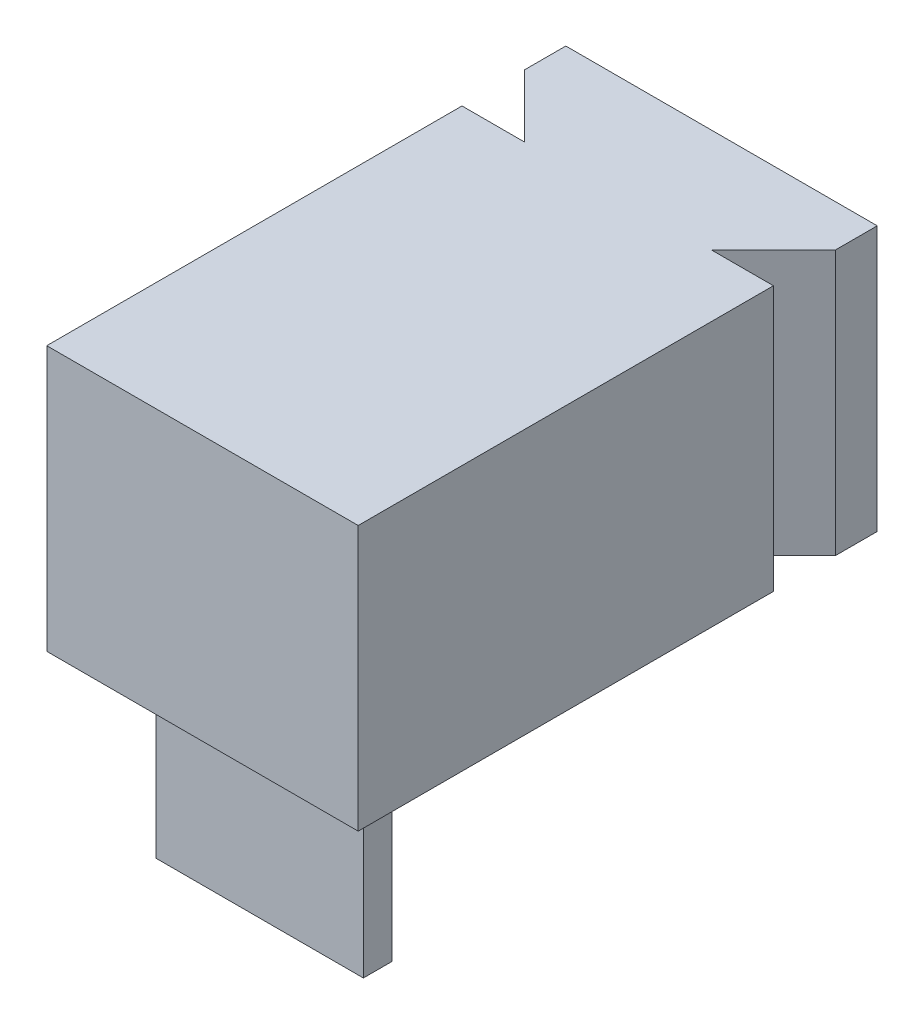
ISO-10303-21;
HEADER;
FILE_DESCRIPTION(('STEP AP214'),'2;1');
FILE_NAME('part.step','',(''),(''),'','','');
FILE_SCHEMA(('AUTOMOTIVE_DESIGN { 1 0 10303 214 1 1 1 1 }'));
ENDSEC;
DATA;
#1=APPLICATION_CONTEXT('core data for automotive mechanical design processes');
#2=APPLICATION_PROTOCOL_DEFINITION('international standard','automotive_design',2000,#1);
#3=PRODUCT_CONTEXT('',#1,'mechanical');
#4=PRODUCT('Part','Part','',(#3));
#5=PRODUCT_RELATED_PRODUCT_CATEGORY('part','',(#4));
#6=PRODUCT_DEFINITION_FORMATION('','',#4);
#7=PRODUCT_DEFINITION_CONTEXT('part definition',#1,'design');
#8=PRODUCT_DEFINITION('design','',#6,#7);
#9=PRODUCT_DEFINITION_SHAPE('','',#8);
#10=(LENGTH_UNIT() NAMED_UNIT(*) SI_UNIT(.MILLI.,.METRE.));
#11=(NAMED_UNIT(*) PLANE_ANGLE_UNIT() SI_UNIT($,.RADIAN.));
#12=(NAMED_UNIT(*) SI_UNIT($,.STERADIAN.) SOLID_ANGLE_UNIT());
#13=UNCERTAINTY_MEASURE_WITH_UNIT(LENGTH_MEASURE(1.E-05),#10,'distance_accuracy_value','');
#14=(GEOMETRIC_REPRESENTATION_CONTEXT(3) GLOBAL_UNCERTAINTY_ASSIGNED_CONTEXT((#13)) GLOBAL_UNIT_ASSIGNED_CONTEXT((#10,
#11,#12)) REPRESENTATION_CONTEXT('',''));
#15=CARTESIAN_POINT('',(0.,0.,0.));
#16=DIRECTION('',(0.,0.,1.));
#17=DIRECTION('',(1.,0.,0.));
#18=AXIS2_PLACEMENT_3D('',#15,#16,#17);
#19=CARTESIAN_POINT('',(0.,0.,0.));
#20=DIRECTION('',(0.,-1.,0.));
#21=DIRECTION('',(0.,0.,-1.));
#22=AXIS2_PLACEMENT_3D('',#19,#20,#21);
#23=PLANE('',#22);
#24=DIRECTION('',(0.,0.,-1.));
#25=VECTOR('',#24,1.);
#26=CARTESIAN_POINT('',(3.,0.,4.));
#27=LINE('',#26,#25);
#28=CARTESIAN_POINT('',(3.,0.,4.));
#29=VERTEX_POINT('',#28);
#30=CARTESIAN_POINT('',(3.,0.,-4.));
#31=VERTEX_POINT('',#30);
#32=EDGE_CURVE('E216',#29,#31,#27,.T.);
#33=ORIENTED_EDGE('',*,*,#32,.F.);
#34=DIRECTION('',(1.,0.,0.));
#35=VECTOR('',#34,1.);
#36=CARTESIAN_POINT('',(-3.,0.,4.));
#37=LINE('',#36,#35);
#38=CARTESIAN_POINT('',(-3.,0.,4.));
#39=VERTEX_POINT('',#38);
#40=EDGE_CURVE('E249',#39,#29,#37,.T.);
#41=ORIENTED_EDGE('',*,*,#40,.F.);
#42=DIRECTION('',(0.,0.,1.));
#43=VECTOR('',#42,1.);
#44=CARTESIAN_POINT('',(-3.,0.,4.));
#45=LINE('',#44,#43);
#46=CARTESIAN_POINT('',(-3.,0.,-4.));
#47=VERTEX_POINT('',#46);
#48=EDGE_CURVE('E234',#47,#39,#45,.T.);
#49=ORIENTED_EDGE('',*,*,#48,.F.);
#50=DIRECTION('',(-1.,0.,0.));
#51=VECTOR('',#50,1.);
#52=CARTESIAN_POINT('',(-3.,0.,-4.));
#53=LINE('',#52,#51);
#54=CARTESIAN_POINT('',(-1.80000000000002,0.,-4.));
#55=VERTEX_POINT('',#54);
#56=EDGE_CURVE('E228',#55,#47,#53,.T.);
#57=ORIENTED_EDGE('',*,*,#56,.F.);
#58=DIRECTION('',(-0.707106781186543,0.,-0.707106781186552));
#59=VECTOR('',#58,1.);
#60=CARTESIAN_POINT('',(-3.,0.,-5.2));
#61=LINE('',#60,#59);
#62=CARTESIAN_POINT('',(-3.,0.,-5.2));
#63=VERTEX_POINT('',#62);
#64=EDGE_CURVE('E183',#55,#63,#61,.T.);
#65=ORIENTED_EDGE('',*,*,#64,.T.);
#66=DIRECTION('',(0.,0.,-1.));
#67=VECTOR('',#66,1.);
#68=CARTESIAN_POINT('',(-3.,0.,-6.));
#69=LINE('',#68,#67);
#70=CARTESIAN_POINT('',(-3.,0.,-6.));
#71=VERTEX_POINT('',#70);
#72=EDGE_CURVE('E179',#63,#71,#69,.T.);
#73=ORIENTED_EDGE('',*,*,#72,.T.);
#74=DIRECTION('',(1.,0.,0.));
#75=VECTOR('',#74,1.);
#76=CARTESIAN_POINT('',(3.,0.,-6.));
#77=LINE('',#76,#75);
#78=CARTESIAN_POINT('',(3.,0.,-6.));
#79=VERTEX_POINT('',#78);
#80=EDGE_CURVE('E182',#71,#79,#77,.T.);
#81=ORIENTED_EDGE('',*,*,#80,.T.);
#82=DIRECTION('',(0.,0.,1.));
#83=VECTOR('',#82,1.);
#84=CARTESIAN_POINT('',(3.,0.,-5.2));
#85=LINE('',#84,#83);
#86=CARTESIAN_POINT('',(3.,0.,-5.2));
#87=VERTEX_POINT('',#86);
#88=EDGE_CURVE('E163',#79,#87,#85,.T.);
#89=ORIENTED_EDGE('',*,*,#88,.T.);
#90=DIRECTION('',(-0.707106781186551,0.,0.707106781186543));
#91=VECTOR('',#90,1.);
#92=CARTESIAN_POINT('',(1.79999999999999,0.,-4.));
#93=LINE('',#92,#91);
#94=CARTESIAN_POINT('',(1.79999999999999,0.,-4.));
#95=VERTEX_POINT('',#94);
#96=EDGE_CURVE('E166',#87,#95,#93,.T.);
#97=ORIENTED_EDGE('',*,*,#96,.T.);
#98=EDGE_CURVE('E235',#31,#95,#53,.T.);
#99=ORIENTED_EDGE('',*,*,#98,.F.);
#100=EDGE_LOOP('',(#33,#41,#49,#57,#65,#73,#81,#89,#97,#99));
#101=FACE_BOUND('',#100,.T.);
#102=DIRECTION('',(-1.,0.,0.));
#103=VECTOR('',#102,1.);
#104=CARTESIAN_POINT('',(-2.,0.,2.9));
#105=LINE('',#104,#103);
#106=CARTESIAN_POINT('',(2.,0.,2.9));
#107=VERTEX_POINT('',#106);
#108=CARTESIAN_POINT('',(-2.,0.,2.9));
#109=VERTEX_POINT('',#108);
#110=EDGE_CURVE('E431',#107,#109,#105,.T.);
#111=ORIENTED_EDGE('',*,*,#110,.F.);
#112=DIRECTION('',(0.,0.,1.));
#113=VECTOR('',#112,1.);
#114=CARTESIAN_POINT('',(2.,0.,2.35));
#115=LINE('',#114,#113);
#116=CARTESIAN_POINT('',(2.,0.,2.35));
#117=VERTEX_POINT('',#116);
#118=EDGE_CURVE('E161',#117,#107,#115,.T.);
#119=ORIENTED_EDGE('',*,*,#118,.F.);
#120=DIRECTION('',(1.,0.,0.));
#121=VECTOR('',#120,1.);
#122=CARTESIAN_POINT('',(-2.,0.,2.35));
#123=LINE('',#122,#121);
#124=CARTESIAN_POINT('',(-2.,0.,2.35));
#125=VERTEX_POINT('',#124);
#126=EDGE_CURVE('E157',#125,#117,#123,.T.);
#127=ORIENTED_EDGE('',*,*,#126,.F.);
#128=DIRECTION('',(0.,0.,-1.));
#129=VECTOR('',#128,1.);
#130=CARTESIAN_POINT('',(-2.,0.,2.35));
#131=LINE('',#130,#129);
#132=EDGE_CURVE('E428',#109,#125,#131,.T.);
#133=ORIENTED_EDGE('',*,*,#132,.F.);
#134=EDGE_LOOP('',(#111,#119,#127,#133));
#135=FACE_BOUND('',#134,.T.);
#136=ADVANCED_FACE('F35',(#101,#135),#23,.T.);
#137=CARTESIAN_POINT('',(-3.,5.1,-4.));
#138=DIRECTION('',(0.,0.,1.));
#139=DIRECTION('',(1.,0.,0.));
#140=AXIS2_PLACEMENT_3D('',#137,#138,#139);
#141=PLANE('',#140);
#142=DIRECTION('',(0.,-1.,0.));
#143=VECTOR('',#142,1.);
#144=CARTESIAN_POINT('',(1.79999999999999,11.4245553203368,-4.));
#145=LINE('',#144,#143);
#146=CARTESIAN_POINT('',(1.79999999999999,5.1,-4.));
#147=VERTEX_POINT('',#146);
#148=EDGE_CURVE('E200',#147,#95,#145,.T.);
#149=ORIENTED_EDGE('',*,*,#148,.F.);
#150=DIRECTION('',(-1.,0.,0.));
#151=VECTOR('',#150,1.);
#152=CARTESIAN_POINT('',(-3.,5.1,-4.));
#153=LINE('',#152,#151);
#154=CARTESIAN_POINT('',(3.,5.1,-4.));
#155=VERTEX_POINT('',#154);
#156=EDGE_CURVE('E242',#155,#147,#153,.T.);
#157=ORIENTED_EDGE('',*,*,#156,.F.);
#158=DIRECTION('',(0.,-1.,0.));
#159=VECTOR('',#158,1.);
#160=CARTESIAN_POINT('',(3.,5.1,-4.));
#161=LINE('',#160,#159);
#162=EDGE_CURVE('E11',#155,#31,#161,.T.);
#163=ORIENTED_EDGE('',*,*,#162,.T.);
#164=ORIENTED_EDGE('',*,*,#98,.T.);
#165=EDGE_LOOP('',(#149,#157,#163,#164));
#166=FACE_BOUND('',#165,.T.);
#167=ADVANCED_FACE('F276',(#166),#141,.F.);
#168=CARTESIAN_POINT('',(3.,5.1,4.));
#169=DIRECTION('',(-1.,0.,0.));
#170=DIRECTION('',(0.,0.,1.));
#171=AXIS2_PLACEMENT_3D('',#168,#169,#170);
#172=PLANE('',#171);
#173=ORIENTED_EDGE('',*,*,#32,.T.);
#174=ORIENTED_EDGE('',*,*,#162,.F.);
#175=DIRECTION('',(0.,0.,-1.));
#176=VECTOR('',#175,1.);
#177=CARTESIAN_POINT('',(3.,5.1,4.));
#178=LINE('',#177,#176);
#179=CARTESIAN_POINT('',(3.,5.1,4.));
#180=VERTEX_POINT('',#179);
#181=EDGE_CURVE('E251',#180,#155,#178,.T.);
#182=ORIENTED_EDGE('',*,*,#181,.F.);
#183=DIRECTION('',(0.,-1.,0.));
#184=VECTOR('',#183,1.);
#185=CARTESIAN_POINT('',(3.,5.1,4.));
#186=LINE('',#185,#184);
#187=EDGE_CURVE('E252',#180,#29,#186,.T.);
#188=ORIENTED_EDGE('',*,*,#187,.T.);
#189=EDGE_LOOP('',(#173,#174,#182,#188));
#190=FACE_BOUND('',#189,.T.);
#191=ADVANCED_FACE('F37',(#190),#172,.F.);
#192=CARTESIAN_POINT('',(-1.80000000000002,5.1,-4.));
#193=VERTEX_POINT('',#192);
#194=CARTESIAN_POINT('',(-3.,5.1,-4.));
#195=VERTEX_POINT('',#194);
#196=EDGE_CURVE('E60',#193,#195,#153,.T.);
#197=ORIENTED_EDGE('',*,*,#196,.F.);
#198=DIRECTION('',(0.,-1.,0.));
#199=VECTOR('',#198,1.);
#200=CARTESIAN_POINT('',(-1.80000000000002,11.4245553203368,-4.));
#201=LINE('',#200,#199);
#202=EDGE_CURVE('E193',#193,#55,#201,.T.);
#203=ORIENTED_EDGE('',*,*,#202,.T.);
#204=ORIENTED_EDGE('',*,*,#56,.T.);
#205=DIRECTION('',(0.,-1.,0.));
#206=VECTOR('',#205,1.);
#207=CARTESIAN_POINT('',(-3.,5.1,-4.));
#208=LINE('',#207,#206);
#209=EDGE_CURVE('E44',#195,#47,#208,.T.);
#210=ORIENTED_EDGE('',*,*,#209,.F.);
#211=EDGE_LOOP('',(#197,#203,#204,#210));
#212=FACE_BOUND('',#211,.T.);
#213=ADVANCED_FACE('F227',(#212),#141,.F.);
#214=CARTESIAN_POINT('',(-3.,5.1,4.));
#215=DIRECTION('',(1.,0.,0.));
#216=DIRECTION('',(0.,0.,-1.));
#217=AXIS2_PLACEMENT_3D('',#214,#215,#216);
#218=PLANE('',#217);
#219=ORIENTED_EDGE('',*,*,#48,.T.);
#220=DIRECTION('',(0.,-1.,0.));
#221=VECTOR('',#220,1.);
#222=CARTESIAN_POINT('',(-3.,5.1,4.));
#223=LINE('',#222,#221);
#224=CARTESIAN_POINT('',(-3.,5.1,4.));
#225=VERTEX_POINT('',#224);
#226=EDGE_CURVE('E255',#225,#39,#223,.T.);
#227=ORIENTED_EDGE('',*,*,#226,.F.);
#228=DIRECTION('',(0.,0.,1.));
#229=VECTOR('',#228,1.);
#230=CARTESIAN_POINT('',(-3.,5.1,4.));
#231=LINE('',#230,#229);
#232=EDGE_CURVE('E263',#195,#225,#231,.T.);
#233=ORIENTED_EDGE('',*,*,#232,.F.);
#234=ORIENTED_EDGE('',*,*,#209,.T.);
#235=EDGE_LOOP('',(#219,#227,#233,#234));
#236=FACE_BOUND('',#235,.T.);
#237=ADVANCED_FACE('F261',(#236),#218,.F.);
#238=CARTESIAN_POINT('',(-3.,5.1,4.));
#239=DIRECTION('',(0.,0.,-1.));
#240=DIRECTION('',(-1.,0.,0.));
#241=AXIS2_PLACEMENT_3D('',#238,#239,#240);
#242=PLANE('',#241);
#243=ORIENTED_EDGE('',*,*,#40,.T.);
#244=ORIENTED_EDGE('',*,*,#187,.F.);
#245=DIRECTION('',(1.,0.,0.));
#246=VECTOR('',#245,1.);
#247=CARTESIAN_POINT('',(-3.,5.1,4.));
#248=LINE('',#247,#246);
#249=EDGE_CURVE('E256',#225,#180,#248,.T.);
#250=ORIENTED_EDGE('',*,*,#249,.F.);
#251=ORIENTED_EDGE('',*,*,#226,.T.);
#252=EDGE_LOOP('',(#243,#244,#250,#251));
#253=FACE_BOUND('',#252,.T.);
#254=ADVANCED_FACE('F310',(#253),#242,.F.);
#255=CARTESIAN_POINT('',(0.,5.1,0.));
#256=DIRECTION('',(0.,-1.,0.));
#257=DIRECTION('',(0.,0.,-1.));
#258=AXIS2_PLACEMENT_3D('',#255,#256,#257);
#259=PLANE('',#258);
#260=ORIENTED_EDGE('',*,*,#181,.T.);
#261=ORIENTED_EDGE('',*,*,#156,.T.);
#262=DIRECTION('',(0.707106781186552,0.,-0.707106781186544));
#263=VECTOR('',#262,1.);
#264=CARTESIAN_POINT('',(1.79999999999999,5.1,-4.));
#265=LINE('',#264,#263);
#266=CARTESIAN_POINT('',(3.,5.1,-5.2));
#267=VERTEX_POINT('',#266);
#268=EDGE_CURVE('E177',#147,#267,#265,.T.);
#269=ORIENTED_EDGE('',*,*,#268,.T.);
#270=DIRECTION('',(0.,0.,-1.));
#271=VECTOR('',#270,1.);
#272=CARTESIAN_POINT('',(3.,5.1,-5.2));
#273=LINE('',#272,#271);
#274=CARTESIAN_POINT('',(3.,5.1,-6.));
#275=VERTEX_POINT('',#274);
#276=EDGE_CURVE('E176',#267,#275,#273,.T.);
#277=ORIENTED_EDGE('',*,*,#276,.T.);
#278=DIRECTION('',(-1.,0.,0.));
#279=VECTOR('',#278,1.);
#280=CARTESIAN_POINT('',(3.,5.1,-6.));
#281=LINE('',#280,#279);
#282=CARTESIAN_POINT('',(-3.,5.1,-6.));
#283=VERTEX_POINT('',#282);
#284=EDGE_CURVE('E173',#275,#283,#281,.T.);
#285=ORIENTED_EDGE('',*,*,#284,.T.);
#286=DIRECTION('',(0.,0.,1.));
#287=VECTOR('',#286,1.);
#288=CARTESIAN_POINT('',(-3.,5.1,-6.));
#289=LINE('',#288,#287);
#290=CARTESIAN_POINT('',(-3.,5.1,-5.2));
#291=VERTEX_POINT('',#290);
#292=EDGE_CURVE('E171',#283,#291,#289,.T.);
#293=ORIENTED_EDGE('',*,*,#292,.T.);
#294=DIRECTION('',(0.707106781186543,0.,0.707106781186552));
#295=VECTOR('',#294,1.);
#296=CARTESIAN_POINT('',(-3.,5.1,-5.2));
#297=LINE('',#296,#295);
#298=EDGE_CURVE('E174',#291,#193,#297,.T.);
#299=ORIENTED_EDGE('',*,*,#298,.T.);
#300=ORIENTED_EDGE('',*,*,#196,.T.);
#301=ORIENTED_EDGE('',*,*,#232,.T.);
#302=ORIENTED_EDGE('',*,*,#249,.T.);
#303=EDGE_LOOP('',(#260,#261,#269,#277,#285,#293,#299,#300,#301,#302));
#304=FACE_BOUND('',#303,.T.);
#305=ADVANCED_FACE('F222',(#304),#259,.F.);
#306=CARTESIAN_POINT('',(3.,11.4245553203368,-5.2));
#307=DIRECTION('',(1.,0.,0.));
#308=DIRECTION('',(0.,0.,-1.));
#309=AXIS2_PLACEMENT_3D('',#306,#307,#308);
#310=PLANE('',#309);
#311=ORIENTED_EDGE('',*,*,#276,.F.);
#312=DIRECTION('',(0.,-1.,0.));
#313=VECTOR('',#312,1.);
#314=CARTESIAN_POINT('',(3.,11.4245553203368,-5.2));
#315=LINE('',#314,#313);
#316=EDGE_CURVE('E186',#267,#87,#315,.T.);
#317=ORIENTED_EDGE('',*,*,#316,.T.);
#318=ORIENTED_EDGE('',*,*,#88,.F.);
#319=DIRECTION('',(0.,-1.,0.));
#320=VECTOR('',#319,1.);
#321=CARTESIAN_POINT('',(3.,11.4245553203368,-6.));
#322=LINE('',#321,#320);
#323=EDGE_CURVE('E187',#275,#79,#322,.T.);
#324=ORIENTED_EDGE('',*,*,#323,.F.);
#325=EDGE_LOOP('',(#311,#317,#318,#324));
#326=FACE_BOUND('',#325,.T.);
#327=ADVANCED_FACE('F283',(#326),#310,.T.);
#328=CARTESIAN_POINT('',(3.,11.4245553203368,-6.));
#329=DIRECTION('',(0.,0.,-1.));
#330=DIRECTION('',(-1.,0.,0.));
#331=AXIS2_PLACEMENT_3D('',#328,#329,#330);
#332=PLANE('',#331);
#333=ORIENTED_EDGE('',*,*,#284,.F.);
#334=ORIENTED_EDGE('',*,*,#323,.T.);
#335=ORIENTED_EDGE('',*,*,#80,.F.);
#336=DIRECTION('',(0.,-1.,0.));
#337=VECTOR('',#336,1.);
#338=CARTESIAN_POINT('',(-3.,11.4245553203368,-6.));
#339=LINE('',#338,#337);
#340=EDGE_CURVE('E189',#283,#71,#339,.T.);
#341=ORIENTED_EDGE('',*,*,#340,.F.);
#342=EDGE_LOOP('',(#333,#334,#335,#341));
#343=FACE_BOUND('',#342,.T.);
#344=ADVANCED_FACE('F291',(#343),#332,.T.);
#345=CARTESIAN_POINT('',(-3.,11.4245553203368,-6.));
#346=DIRECTION('',(-1.,0.,0.));
#347=DIRECTION('',(0.,0.,1.));
#348=AXIS2_PLACEMENT_3D('',#345,#346,#347);
#349=PLANE('',#348);
#350=ORIENTED_EDGE('',*,*,#292,.F.);
#351=ORIENTED_EDGE('',*,*,#340,.T.);
#352=ORIENTED_EDGE('',*,*,#72,.F.);
#353=DIRECTION('',(0.,-1.,0.));
#354=VECTOR('',#353,1.);
#355=CARTESIAN_POINT('',(-3.,11.4245553203368,-5.2));
#356=LINE('',#355,#354);
#357=EDGE_CURVE('E191',#291,#63,#356,.T.);
#358=ORIENTED_EDGE('',*,*,#357,.F.);
#359=EDGE_LOOP('',(#350,#351,#352,#358));
#360=FACE_BOUND('',#359,.T.);
#361=ADVANCED_FACE('F293',(#360),#349,.T.);
#362=CARTESIAN_POINT('',(-3.,11.4245553203368,-5.2));
#363=DIRECTION('',(-0.707106781186552,0.,0.707106781186543));
#364=DIRECTION('',(0.707106781186543,0.,0.707106781186552));
#365=AXIS2_PLACEMENT_3D('',#362,#363,#364);
#366=PLANE('',#365);
#367=ORIENTED_EDGE('',*,*,#298,.F.);
#368=ORIENTED_EDGE('',*,*,#357,.T.);
#369=ORIENTED_EDGE('',*,*,#64,.F.);
#370=ORIENTED_EDGE('',*,*,#202,.F.);
#371=EDGE_LOOP('',(#367,#368,#369,#370));
#372=FACE_BOUND('',#371,.T.);
#373=ADVANCED_FACE('F226',(#372),#366,.T.);
#374=CARTESIAN_POINT('',(1.79999999999999,11.4245553203368,-4.));
#375=DIRECTION('',(0.707106781186544,0.,0.707106781186552));
#376=DIRECTION('',(0.707106781186552,0.,-0.707106781186544));
#377=AXIS2_PLACEMENT_3D('',#374,#375,#376);
#378=PLANE('',#377);
#379=ORIENTED_EDGE('',*,*,#268,.F.);
#380=ORIENTED_EDGE('',*,*,#148,.T.);
#381=ORIENTED_EDGE('',*,*,#96,.F.);
#382=ORIENTED_EDGE('',*,*,#316,.F.);
#383=EDGE_LOOP('',(#379,#380,#381,#382));
#384=FACE_BOUND('',#383,.T.);
#385=ADVANCED_FACE('F285',(#384),#378,.T.);
#386=CARTESIAN_POINT('',(2.,-3.5,2.35));
#387=DIRECTION('',(-1.,0.,0.));
#388=DIRECTION('',(0.,0.,1.));
#389=AXIS2_PLACEMENT_3D('',#386,#387,#388);
#390=PLANE('',#389);
#391=ORIENTED_EDGE('',*,*,#118,.T.);
#392=DIRECTION('',(0.,1.,0.));
#393=VECTOR('',#392,1.);
#394=CARTESIAN_POINT('',(2.,-3.5,2.9));
#395=LINE('',#394,#393);
#396=CARTESIAN_POINT('',(2.,-3.5,2.9));
#397=VERTEX_POINT('',#396);
#398=EDGE_CURVE('E142',#397,#107,#395,.T.);
#399=ORIENTED_EDGE('',*,*,#398,.F.);
#400=DIRECTION('',(0.,0.,1.));
#401=VECTOR('',#400,1.);
#402=CARTESIAN_POINT('',(2.,-3.5,2.35));
#403=LINE('',#402,#401);
#404=CARTESIAN_POINT('',(2.,-3.5,2.35));
#405=VERTEX_POINT('',#404);
#406=EDGE_CURVE('E149',#405,#397,#403,.T.);
#407=ORIENTED_EDGE('',*,*,#406,.F.);
#408=DIRECTION('',(0.,1.,0.));
#409=VECTOR('',#408,1.);
#410=CARTESIAN_POINT('',(2.,-3.5,2.35));
#411=LINE('',#410,#409);
#412=EDGE_CURVE('E426',#405,#117,#411,.T.);
#413=ORIENTED_EDGE('',*,*,#412,.T.);
#414=EDGE_LOOP('',(#391,#399,#407,#413));
#415=FACE_BOUND('',#414,.T.);
#416=ADVANCED_FACE('F159',(#415),#390,.F.);
#417=CARTESIAN_POINT('',(-2.,-3.5,2.9));
#418=DIRECTION('',(0.,0.,-1.));
#419=DIRECTION('',(-1.,0.,0.));
#420=AXIS2_PLACEMENT_3D('',#417,#418,#419);
#421=PLANE('',#420);
#422=ORIENTED_EDGE('',*,*,#110,.T.);
#423=DIRECTION('',(0.,1.,0.));
#424=VECTOR('',#423,1.);
#425=CARTESIAN_POINT('',(-2.,-3.5,2.9));
#426=LINE('',#425,#424);
#427=CARTESIAN_POINT('',(-2.,-3.5,2.9));
#428=VERTEX_POINT('',#427);
#429=EDGE_CURVE('E145',#428,#109,#426,.T.);
#430=ORIENTED_EDGE('',*,*,#429,.F.);
#431=DIRECTION('',(-1.,0.,0.));
#432=VECTOR('',#431,1.);
#433=CARTESIAN_POINT('',(-2.,-3.5,2.9));
#434=LINE('',#433,#432);
#435=EDGE_CURVE('E138',#397,#428,#434,.T.);
#436=ORIENTED_EDGE('',*,*,#435,.F.);
#437=ORIENTED_EDGE('',*,*,#398,.T.);
#438=EDGE_LOOP('',(#422,#430,#436,#437));
#439=FACE_BOUND('',#438,.T.);
#440=ADVANCED_FACE('F140',(#439),#421,.F.);
#441=CARTESIAN_POINT('',(-2.,-3.5,2.35));
#442=DIRECTION('',(1.,0.,0.));
#443=DIRECTION('',(0.,0.,-1.));
#444=AXIS2_PLACEMENT_3D('',#441,#442,#443);
#445=PLANE('',#444);
#446=ORIENTED_EDGE('',*,*,#132,.T.);
#447=DIRECTION('',(0.,1.,0.));
#448=VECTOR('',#447,1.);
#449=CARTESIAN_POINT('',(-2.,-3.5,2.35));
#450=LINE('',#449,#448);
#451=CARTESIAN_POINT('',(-2.,-3.5,2.35));
#452=VERTEX_POINT('',#451);
#453=EDGE_CURVE('E52',#452,#125,#450,.T.);
#454=ORIENTED_EDGE('',*,*,#453,.F.);
#455=DIRECTION('',(0.,0.,-1.));
#456=VECTOR('',#455,1.);
#457=CARTESIAN_POINT('',(-2.,-3.5,2.35));
#458=LINE('',#457,#456);
#459=EDGE_CURVE('E148',#428,#452,#458,.T.);
#460=ORIENTED_EDGE('',*,*,#459,.F.);
#461=ORIENTED_EDGE('',*,*,#429,.T.);
#462=EDGE_LOOP('',(#446,#454,#460,#461));
#463=FACE_BOUND('',#462,.T.);
#464=ADVANCED_FACE('F395',(#463),#445,.F.);
#465=CARTESIAN_POINT('',(-2.,-3.5,2.35));
#466=DIRECTION('',(0.,0.,1.));
#467=DIRECTION('',(1.,0.,0.));
#468=AXIS2_PLACEMENT_3D('',#465,#466,#467);
#469=PLANE('',#468);
#470=ORIENTED_EDGE('',*,*,#126,.T.);
#471=ORIENTED_EDGE('',*,*,#412,.F.);
#472=DIRECTION('',(1.,0.,0.));
#473=VECTOR('',#472,1.);
#474=CARTESIAN_POINT('',(-2.,-3.5,2.35));
#475=LINE('',#474,#473);
#476=EDGE_CURVE('E153',#452,#405,#475,.T.);
#477=ORIENTED_EDGE('',*,*,#476,.F.);
#478=ORIENTED_EDGE('',*,*,#453,.T.);
#479=EDGE_LOOP('',(#470,#471,#477,#478));
#480=FACE_BOUND('',#479,.T.);
#481=ADVANCED_FACE('F404',(#480),#469,.F.);
#482=CARTESIAN_POINT('',(0.,-3.5,0.));
#483=DIRECTION('',(0.,1.,0.));
#484=DIRECTION('',(0.,0.,1.));
#485=AXIS2_PLACEMENT_3D('',#482,#483,#484);
#486=PLANE('',#485);
#487=ORIENTED_EDGE('',*,*,#406,.T.);
#488=ORIENTED_EDGE('',*,*,#435,.T.);
#489=ORIENTED_EDGE('',*,*,#459,.T.);
#490=ORIENTED_EDGE('',*,*,#476,.T.);
#491=EDGE_LOOP('',(#487,#488,#489,#490));
#492=FACE_BOUND('',#491,.T.);
#493=ADVANCED_FACE('F152',(#492),#486,.F.);
#494=CLOSED_SHELL('',(#136,#167,#191,#213,#237,#254,#305,#327,#344,#361,#373,#385,#416,#440,
#464,#481,#493));
#495=MANIFOLD_SOLID_BREP('B2',#494);
#496=ADVANCED_BREP_SHAPE_REPRESENTATION('',(#18,#495),#14);
#497=SHAPE_DEFINITION_REPRESENTATION(#9,#496);
ENDSEC;
END-ISO-10303-21;
